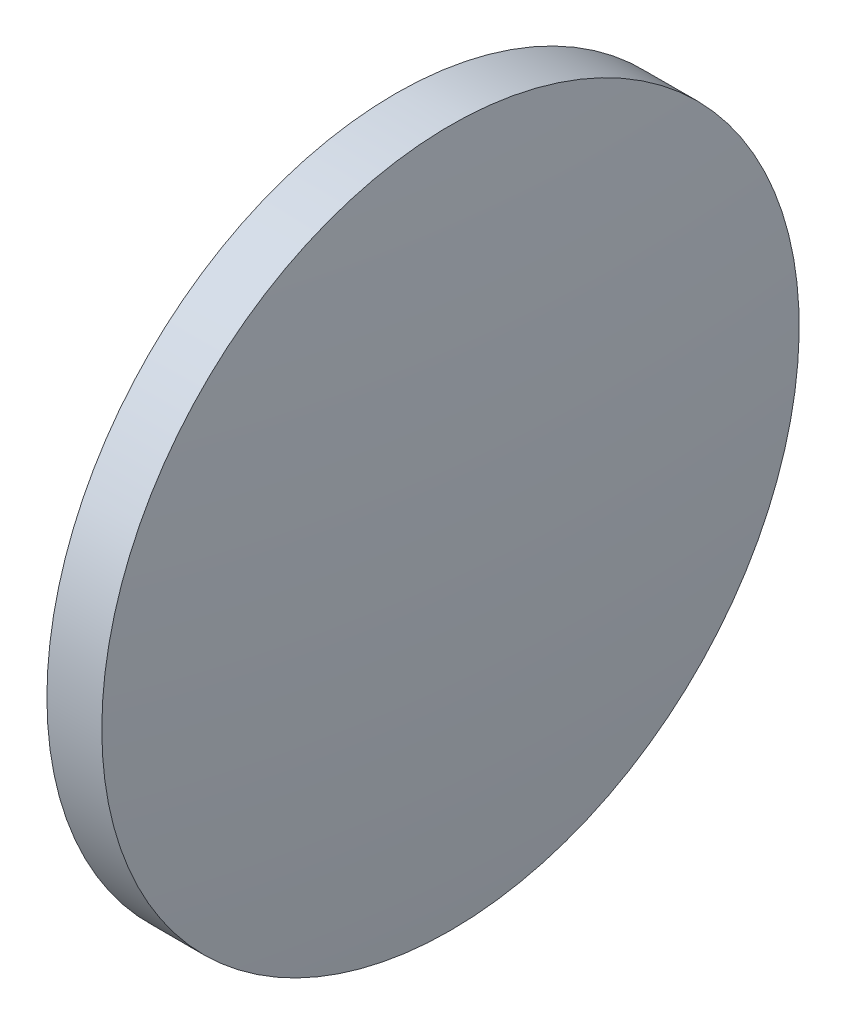
ISO-10303-21;
HEADER;
FILE_DESCRIPTION(('STEP AP214'),'2;1');
FILE_NAME('part.step','',(''),(''),'','','');
FILE_SCHEMA(('AUTOMOTIVE_DESIGN { 1 0 10303 214 1 1 1 1 }'));
ENDSEC;
DATA;
#1=APPLICATION_CONTEXT('core data for automotive mechanical design processes');
#2=APPLICATION_PROTOCOL_DEFINITION('international standard','automotive_design',2000,#1);
#3=PRODUCT_CONTEXT('',#1,'mechanical');
#4=PRODUCT('Part','Part','',(#3));
#5=PRODUCT_RELATED_PRODUCT_CATEGORY('part','',(#4));
#6=PRODUCT_DEFINITION_FORMATION('','',#4);
#7=PRODUCT_DEFINITION_CONTEXT('part definition',#1,'design');
#8=PRODUCT_DEFINITION('design','',#6,#7);
#9=PRODUCT_DEFINITION_SHAPE('','',#8);
#10=(LENGTH_UNIT() NAMED_UNIT(*) SI_UNIT(.MILLI.,.METRE.));
#11=(NAMED_UNIT(*) PLANE_ANGLE_UNIT() SI_UNIT($,.RADIAN.));
#12=(NAMED_UNIT(*) SI_UNIT($,.STERADIAN.) SOLID_ANGLE_UNIT());
#13=UNCERTAINTY_MEASURE_WITH_UNIT(LENGTH_MEASURE(1.E-05),#10,'distance_accuracy_value','');
#14=(GEOMETRIC_REPRESENTATION_CONTEXT(3) GLOBAL_UNCERTAINTY_ASSIGNED_CONTEXT((#13)) GLOBAL_UNIT_ASSIGNED_CONTEXT((#10,
#11,#12)) REPRESENTATION_CONTEXT('',''));
#15=CARTESIAN_POINT('',(0.,0.,0.));
#16=DIRECTION('',(0.,0.,1.));
#17=DIRECTION('',(1.,0.,0.));
#18=AXIS2_PLACEMENT_3D('',#15,#16,#17);
#19=CARTESIAN_POINT('',(219.52966077069,48.6161130231847,0.));
#20=DIRECTION('',(-1.,0.,0.));
#21=DIRECTION('',(0.,1.,0.));
#22=AXIS2_PLACEMENT_3D('',#19,#20,#21);
#23=SPHERICAL_SURFACE('',#22,134.671304138885);
#24=CARTESIAN_POINT('',(85.4585223460911,48.6161130231848,0.));
#25=DIRECTION('',(-1.,0.,0.));
#26=DIRECTION('',(0.,0.,1.));
#27=AXIS2_PLACEMENT_3D('',#24,#25,#26);
#28=CIRCLE('',#27,12.7);
#29=CARTESIAN_POINT('',(85.4585223460911,48.6161130231848,12.7));
#30=VERTEX_POINT('',#29);
#31=EDGE_CURVE('E46',#30,#30,#28,.T.);
#32=ORIENTED_EDGE('',*,*,#31,.T.);
#33=EDGE_LOOP('',(#32));
#34=FACE_BOUND('',#33,.T.);
#35=ADVANCED_FACE('F39',(#34),#23,.T.);
#36=CARTESIAN_POINT('',(-46.6132732213645,48.6161130231849,0.));
#37=DIRECTION('',(-1.,0.,0.));
#38=DIRECTION('',(0.,-1.,0.));
#39=AXIS2_PLACEMENT_3D('',#36,#37,#38);
#40=SPHERICAL_SURFACE('',#39,134.671304138884);
#41=CARTESIAN_POINT('',(87.457865203234,48.6161130231848,0.));
#42=DIRECTION('',(-1.,0.,0.));
#43=DIRECTION('',(0.,0.,1.));
#44=AXIS2_PLACEMENT_3D('',#41,#42,#43);
#45=CIRCLE('',#44,12.7);
#46=CARTESIAN_POINT('',(87.457865203234,48.6161130231848,12.7));
#47=VERTEX_POINT('',#46);
#48=EDGE_CURVE('E10',#47,#47,#45,.T.);
#49=ORIENTED_EDGE('',*,*,#48,.F.);
#50=EDGE_LOOP('',(#49));
#51=FACE_BOUND('',#50,.T.);
#52=ADVANCED_FACE('F56',(#51),#40,.T.);
#53=CARTESIAN_POINT('',(79.3054013508372,48.6161130231848,0.));
#54=DIRECTION('',(-1.,0.,0.));
#55=DIRECTION('',(0.,0.,1.));
#56=AXIS2_PLACEMENT_3D('',#53,#54,#55);
#57=CYLINDRICAL_SURFACE('',#56,12.7);
#58=ORIENTED_EDGE('',*,*,#48,.T.);
#59=EDGE_LOOP('',(#58));
#60=FACE_BOUND('',#59,.T.);
#61=ORIENTED_EDGE('',*,*,#31,.F.);
#62=EDGE_LOOP('',(#61));
#63=FACE_BOUND('',#62,.T.);
#64=ADVANCED_FACE('F54',(#60,#63),#57,.T.);
#65=CLOSED_SHELL('',(#35,#52,#64));
#66=MANIFOLD_SOLID_BREP('B2',#65);
#67=ADVANCED_BREP_SHAPE_REPRESENTATION('',(#18,#66),#14);
#68=SHAPE_DEFINITION_REPRESENTATION(#9,#67);
ENDSEC;
END-ISO-10303-21;
